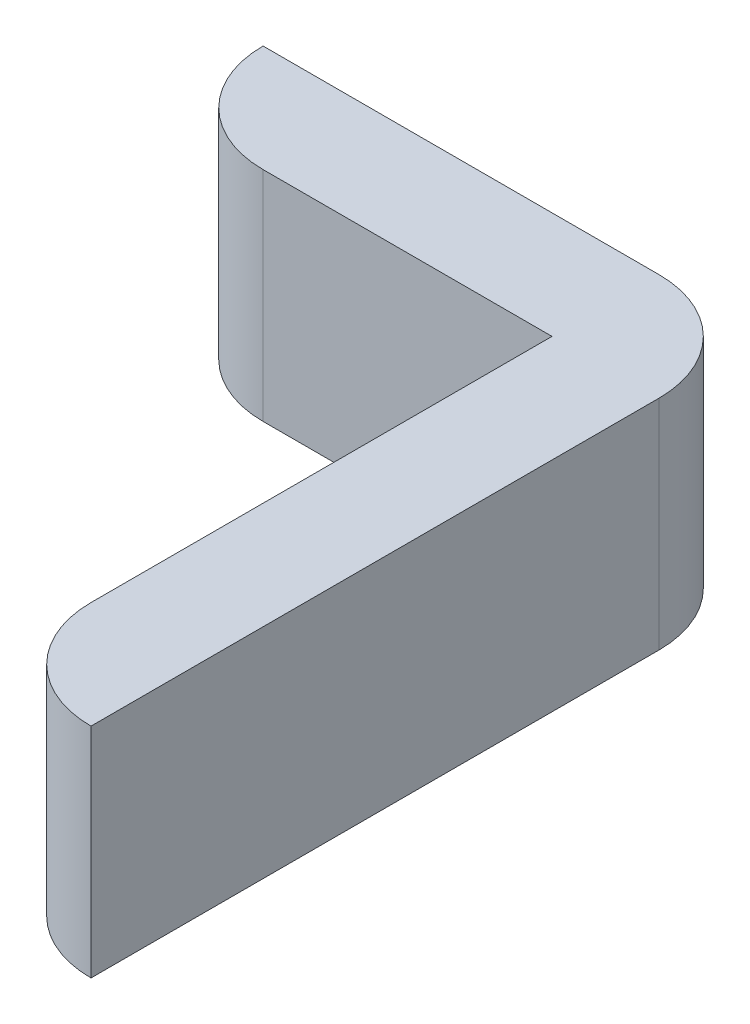
ISO-10303-21;
HEADER;
FILE_DESCRIPTION(('STEP AP214'),'2;1');
FILE_NAME('part.step','',(''),(''),'','','');
FILE_SCHEMA(('AUTOMOTIVE_DESIGN { 1 0 10303 214 1 1 1 1 }'));
ENDSEC;
DATA;
#1=APPLICATION_CONTEXT('core data for automotive mechanical design processes');
#2=APPLICATION_PROTOCOL_DEFINITION('international standard','automotive_design',2000,#1);
#3=PRODUCT_CONTEXT('',#1,'mechanical');
#4=PRODUCT('Part','Part','',(#3));
#5=PRODUCT_RELATED_PRODUCT_CATEGORY('part','',(#4));
#6=PRODUCT_DEFINITION_FORMATION('','',#4);
#7=PRODUCT_DEFINITION_CONTEXT('part definition',#1,'design');
#8=PRODUCT_DEFINITION('design','',#6,#7);
#9=PRODUCT_DEFINITION_SHAPE('','',#8);
#10=(LENGTH_UNIT() NAMED_UNIT(*) SI_UNIT(.MILLI.,.METRE.));
#11=(NAMED_UNIT(*) PLANE_ANGLE_UNIT() SI_UNIT($,.RADIAN.));
#12=(NAMED_UNIT(*) SI_UNIT($,.STERADIAN.) SOLID_ANGLE_UNIT());
#13=UNCERTAINTY_MEASURE_WITH_UNIT(LENGTH_MEASURE(1.E-05),#10,'distance_accuracy_value','');
#14=(GEOMETRIC_REPRESENTATION_CONTEXT(3) GLOBAL_UNCERTAINTY_ASSIGNED_CONTEXT((#13)) GLOBAL_UNIT_ASSIGNED_CONTEXT((#10,
#11,#12)) REPRESENTATION_CONTEXT('',''));
#15=CARTESIAN_POINT('',(0.,0.,0.));
#16=DIRECTION('',(0.,0.,1.));
#17=DIRECTION('',(1.,0.,0.));
#18=AXIS2_PLACEMENT_3D('',#15,#16,#17);
#19=CARTESIAN_POINT('',(-0.125,-6.0952,0.));
#20=DIRECTION('',(0.,-1.,0.));
#21=DIRECTION('',(0.,0.,-1.));
#22=AXIS2_PLACEMENT_3D('',#19,#20,#21);
#23=PLANE('',#22);
#24=DIRECTION('',(-1.,0.,0.));
#25=VECTOR('',#24,1.);
#26=CARTESIAN_POINT('',(0.125,-6.0952,0.25));
#27=LINE('',#26,#25);
#28=CARTESIAN_POINT('',(0.125,-6.0952,0.25));
#29=VERTEX_POINT('',#28);
#30=CARTESIAN_POINT('',(0.8,-6.0952,0.25));
#31=VERTEX_POINT('',#30);
#32=EDGE_CURVE('E102',#29,#31,#27,.F.);
#33=ORIENTED_EDGE('',*,*,#32,.T.);
#34=DIRECTION('',(0.,0.,-1.));
#35=VECTOR('',#34,1.);
#36=CARTESIAN_POINT('',(0.8,-6.0952,0.25));
#37=LINE('',#36,#35);
#38=CARTESIAN_POINT('',(0.8,-6.0952,1.327));
#39=VERTEX_POINT('',#38);
#40=EDGE_CURVE('E108',#31,#39,#37,.F.);
#41=ORIENTED_EDGE('',*,*,#40,.T.);
#42=CARTESIAN_POINT('',(1.05,-6.0952,1.327));
#43=DIRECTION('',(0.,-1.,0.));
#44=DIRECTION('',(0.,0.,-1.));
#45=AXIS2_PLACEMENT_3D('',#42,#43,#44);
#46=CIRCLE('',#45,0.25);
#47=CARTESIAN_POINT('',(1.05,-6.0952,1.577));
#48=VERTEX_POINT('',#47);
#49=EDGE_CURVE('E80',#48,#39,#46,.T.);
#50=ORIENTED_EDGE('',*,*,#49,.F.);
#51=DIRECTION('',(0.,0.,1.));
#52=VECTOR('',#51,1.);
#53=CARTESIAN_POINT('',(1.05,-6.0952,1.577));
#54=LINE('',#53,#52);
#55=CARTESIAN_POINT('',(1.05,-6.0952,0.25));
#56=VERTEX_POINT('',#55);
#57=EDGE_CURVE('E75',#48,#56,#54,.F.);
#58=ORIENTED_EDGE('',*,*,#57,.T.);
#59=CARTESIAN_POINT('',(0.8,-6.0952,0.25));
#60=DIRECTION('',(0.,-1.,0.));
#61=DIRECTION('',(0.,0.,-1.));
#62=AXIS2_PLACEMENT_3D('',#59,#60,#61);
#63=CIRCLE('',#62,0.25);
#64=CARTESIAN_POINT('',(0.8,-6.0952,0.));
#65=VERTEX_POINT('',#64);
#66=EDGE_CURVE('E19',#65,#56,#63,.T.);
#67=ORIENTED_EDGE('',*,*,#66,.F.);
#68=DIRECTION('',(1.,0.,0.));
#69=VECTOR('',#68,1.);
#70=CARTESIAN_POINT('',(0.8,-6.0952,0.));
#71=LINE('',#70,#69);
#72=CARTESIAN_POINT('',(-0.125,-6.0952,0.));
#73=VERTEX_POINT('',#72);
#74=EDGE_CURVE('E70',#65,#73,#71,.F.);
#75=ORIENTED_EDGE('',*,*,#74,.T.);
#76=CARTESIAN_POINT('',(0.125,-6.0952,0.));
#77=DIRECTION('',(0.,-1.,0.));
#78=DIRECTION('',(0.,0.,-1.));
#79=AXIS2_PLACEMENT_3D('',#76,#77,#78);
#80=CIRCLE('',#79,0.25);
#81=EDGE_CURVE('E121',#29,#73,#80,.T.);
#82=ORIENTED_EDGE('',*,*,#81,.F.);
#83=EDGE_LOOP('',(#33,#41,#50,#58,#67,#75,#82));
#84=FACE_BOUND('',#83,.T.);
#85=ADVANCED_FACE('F16',(#84),#23,.F.);
#86=CARTESIAN_POINT('',(0.8,-6.6048,0.));
#87=DIRECTION('',(0.,0.,1.));
#88=DIRECTION('',(1.,0.,0.));
#89=AXIS2_PLACEMENT_3D('',#86,#87,#88);
#90=PLANE('',#89);
#91=DIRECTION('',(0.,-1.,0.));
#92=VECTOR('',#91,1.);
#93=CARTESIAN_POINT('',(-0.125,-6.6048,0.));
#94=LINE('',#93,#92);
#95=CARTESIAN_POINT('',(-0.125,-6.6048,0.));
#96=VERTEX_POINT('',#95);
#97=EDGE_CURVE('E123',#73,#96,#94,.T.);
#98=ORIENTED_EDGE('',*,*,#97,.F.);
#99=ORIENTED_EDGE('',*,*,#74,.F.);
#100=DIRECTION('',(0.,-1.,0.));
#101=VECTOR('',#100,1.);
#102=CARTESIAN_POINT('',(0.8,-6.6048,0.));
#103=LINE('',#102,#101);
#104=CARTESIAN_POINT('',(0.8,-6.6048,0.));
#105=VERTEX_POINT('',#104);
#106=EDGE_CURVE('E92',#105,#65,#103,.F.);
#107=ORIENTED_EDGE('',*,*,#106,.F.);
#108=DIRECTION('',(1.,0.,0.));
#109=VECTOR('',#108,1.);
#110=CARTESIAN_POINT('',(-0.125,-6.6048,0.));
#111=LINE('',#110,#109);
#112=EDGE_CURVE('E120',#96,#105,#111,.T.);
#113=ORIENTED_EDGE('',*,*,#112,.F.);
#114=EDGE_LOOP('',(#98,#99,#107,#113));
#115=FACE_BOUND('',#114,.T.);
#116=ADVANCED_FACE('F158',(#115),#90,.F.);
#117=CARTESIAN_POINT('',(0.8,-6.6048,0.25));
#118=DIRECTION('',(0.,-1.,0.));
#119=DIRECTION('',(0.,0.,-1.));
#120=AXIS2_PLACEMENT_3D('',#117,#118,#119);
#121=CYLINDRICAL_SURFACE('',#120,0.25);
#122=ORIENTED_EDGE('',*,*,#66,.T.);
#123=DIRECTION('',(0.,1.,0.));
#124=VECTOR('',#123,1.);
#125=CARTESIAN_POINT('',(1.05,-6.6048,0.25));
#126=LINE('',#125,#124);
#127=CARTESIAN_POINT('',(1.05,-6.6048,0.25));
#128=VERTEX_POINT('',#127);
#129=EDGE_CURVE('E86',#56,#128,#126,.F.);
#130=ORIENTED_EDGE('',*,*,#129,.T.);
#131=CARTESIAN_POINT('',(0.8,-6.6048,0.25));
#132=DIRECTION('',(0.,-1.,0.));
#133=DIRECTION('',(0.,0.,-1.));
#134=AXIS2_PLACEMENT_3D('',#131,#132,#133);
#135=CIRCLE('',#134,0.25);
#136=EDGE_CURVE('E118',#105,#128,#135,.T.);
#137=ORIENTED_EDGE('',*,*,#136,.F.);
#138=ORIENTED_EDGE('',*,*,#106,.T.);
#139=EDGE_LOOP('',(#122,#130,#137,#138));
#140=FACE_BOUND('',#139,.T.);
#141=ADVANCED_FACE('F89',(#140),#121,.T.);
#142=CARTESIAN_POINT('',(1.05,-6.6048,1.577));
#143=DIRECTION('',(-1.,0.,0.));
#144=DIRECTION('',(0.,0.,1.));
#145=AXIS2_PLACEMENT_3D('',#142,#143,#144);
#146=PLANE('',#145);
#147=DIRECTION('',(0.,-1.,0.));
#148=VECTOR('',#147,1.);
#149=CARTESIAN_POINT('',(1.05,-6.6048,1.577));
#150=LINE('',#149,#148);
#151=CARTESIAN_POINT('',(1.05,-6.6048,1.577));
#152=VERTEX_POINT('',#151);
#153=EDGE_CURVE('E85',#152,#48,#150,.F.);
#154=ORIENTED_EDGE('',*,*,#153,.F.);
#155=DIRECTION('',(0.,0.,-1.));
#156=VECTOR('',#155,1.);
#157=CARTESIAN_POINT('',(1.05,-6.6048,0.));
#158=LINE('',#157,#156);
#159=EDGE_CURVE('E94',#128,#152,#158,.F.);
#160=ORIENTED_EDGE('',*,*,#159,.F.);
#161=ORIENTED_EDGE('',*,*,#129,.F.);
#162=ORIENTED_EDGE('',*,*,#57,.F.);
#163=EDGE_LOOP('',(#154,#160,#161,#162));
#164=FACE_BOUND('',#163,.T.);
#165=ADVANCED_FACE('F93',(#164),#146,.F.);
#166=CARTESIAN_POINT('',(1.05,-6.6048,1.327));
#167=DIRECTION('',(0.,-1.,0.));
#168=DIRECTION('',(0.,0.,-1.));
#169=AXIS2_PLACEMENT_3D('',#166,#167,#168);
#170=CYLINDRICAL_SURFACE('',#169,0.25);
#171=ORIENTED_EDGE('',*,*,#49,.T.);
#172=DIRECTION('',(0.,1.,0.));
#173=VECTOR('',#172,1.);
#174=CARTESIAN_POINT('',(0.8,-6.6048,1.327));
#175=LINE('',#174,#173);
#176=CARTESIAN_POINT('',(0.8,-6.6048,1.327));
#177=VERTEX_POINT('',#176);
#178=EDGE_CURVE('E105',#39,#177,#175,.F.);
#179=ORIENTED_EDGE('',*,*,#178,.T.);
#180=CARTESIAN_POINT('',(1.05,-6.6048,1.327));
#181=DIRECTION('',(0.,-1.,0.));
#182=DIRECTION('',(0.,0.,-1.));
#183=AXIS2_PLACEMENT_3D('',#180,#181,#182);
#184=CIRCLE('',#183,0.25);
#185=EDGE_CURVE('E114',#152,#177,#184,.T.);
#186=ORIENTED_EDGE('',*,*,#185,.F.);
#187=ORIENTED_EDGE('',*,*,#153,.T.);
#188=EDGE_LOOP('',(#171,#179,#186,#187));
#189=FACE_BOUND('',#188,.T.);
#190=ADVANCED_FACE('F127',(#189),#170,.T.);
#191=CARTESIAN_POINT('',(0.8,-6.6048,0.25));
#192=DIRECTION('',(1.,0.,0.));
#193=DIRECTION('',(0.,0.,-1.));
#194=AXIS2_PLACEMENT_3D('',#191,#192,#193);
#195=PLANE('',#194);
#196=ORIENTED_EDGE('',*,*,#178,.F.);
#197=ORIENTED_EDGE('',*,*,#40,.F.);
#198=DIRECTION('',(0.,1.,0.));
#199=VECTOR('',#198,1.);
#200=CARTESIAN_POINT('',(0.8,-6.6048,0.25));
#201=LINE('',#200,#199);
#202=CARTESIAN_POINT('',(0.8,-6.6048,0.25));
#203=VERTEX_POINT('',#202);
#204=EDGE_CURVE('E104',#31,#203,#201,.F.);
#205=ORIENTED_EDGE('',*,*,#204,.T.);
#206=DIRECTION('',(0.,0.,-1.));
#207=VECTOR('',#206,1.);
#208=CARTESIAN_POINT('',(0.8,-6.6048,0.));
#209=LINE('',#208,#207);
#210=EDGE_CURVE('E117',#177,#203,#209,.T.);
#211=ORIENTED_EDGE('',*,*,#210,.F.);
#212=EDGE_LOOP('',(#196,#197,#205,#211));
#213=FACE_BOUND('',#212,.T.);
#214=ADVANCED_FACE('F150',(#213),#195,.F.);
#215=CARTESIAN_POINT('',(0.125,-6.6048,0.25));
#216=DIRECTION('',(0.,0.,-1.));
#217=DIRECTION('',(-1.,0.,0.));
#218=AXIS2_PLACEMENT_3D('',#215,#216,#217);
#219=PLANE('',#218);
#220=ORIENTED_EDGE('',*,*,#204,.F.);
#221=ORIENTED_EDGE('',*,*,#32,.F.);
#222=DIRECTION('',(0.,-1.,0.));
#223=VECTOR('',#222,1.);
#224=CARTESIAN_POINT('',(0.125,-6.6048,0.25));
#225=LINE('',#224,#223);
#226=CARTESIAN_POINT('',(0.125,-6.6048,0.25));
#227=VERTEX_POINT('',#226);
#228=EDGE_CURVE('E34',#227,#29,#225,.F.);
#229=ORIENTED_EDGE('',*,*,#228,.F.);
#230=DIRECTION('',(1.,0.,0.));
#231=VECTOR('',#230,1.);
#232=CARTESIAN_POINT('',(-0.125,-6.6048,0.25));
#233=LINE('',#232,#231);
#234=EDGE_CURVE('E25',#203,#227,#233,.F.);
#235=ORIENTED_EDGE('',*,*,#234,.F.);
#236=EDGE_LOOP('',(#220,#221,#229,#235));
#237=FACE_BOUND('',#236,.T.);
#238=ADVANCED_FACE('F151',(#237),#219,.F.);
#239=CARTESIAN_POINT('',(0.125,-6.6048,0.));
#240=DIRECTION('',(0.,-1.,0.));
#241=DIRECTION('',(0.,0.,-1.));
#242=AXIS2_PLACEMENT_3D('',#239,#240,#241);
#243=CYLINDRICAL_SURFACE('',#242,0.25);
#244=ORIENTED_EDGE('',*,*,#81,.T.);
#245=ORIENTED_EDGE('',*,*,#97,.T.);
#246=CARTESIAN_POINT('',(0.125,-6.6048,0.));
#247=DIRECTION('',(0.,-1.,0.));
#248=DIRECTION('',(0.,0.,-1.));
#249=AXIS2_PLACEMENT_3D('',#246,#247,#248);
#250=CIRCLE('',#249,0.25);
#251=EDGE_CURVE('E11',#227,#96,#250,.T.);
#252=ORIENTED_EDGE('',*,*,#251,.F.);
#253=ORIENTED_EDGE('',*,*,#228,.T.);
#254=EDGE_LOOP('',(#244,#245,#252,#253));
#255=FACE_BOUND('',#254,.T.);
#256=ADVANCED_FACE('F156',(#255),#243,.T.);
#257=CARTESIAN_POINT('',(-0.125,-6.6048,0.));
#258=DIRECTION('',(0.,-1.,0.));
#259=DIRECTION('',(0.,0.,-1.));
#260=AXIS2_PLACEMENT_3D('',#257,#258,#259);
#261=PLANE('',#260);
#262=ORIENTED_EDGE('',*,*,#234,.T.);
#263=ORIENTED_EDGE('',*,*,#251,.T.);
#264=ORIENTED_EDGE('',*,*,#112,.T.);
#265=ORIENTED_EDGE('',*,*,#136,.T.);
#266=ORIENTED_EDGE('',*,*,#159,.T.);
#267=ORIENTED_EDGE('',*,*,#185,.T.);
#268=ORIENTED_EDGE('',*,*,#210,.T.);
#269=EDGE_LOOP('',(#262,#263,#264,#265,#266,#267,#268));
#270=FACE_BOUND('',#269,.T.);
#271=ADVANCED_FACE('F132',(#270),#261,.T.);
#272=CLOSED_SHELL('',(#85,#116,#141,#165,#190,#214,#238,#256,#271));
#273=MANIFOLD_SOLID_BREP('B1',#272);
#274=ADVANCED_BREP_SHAPE_REPRESENTATION('',(#18,#273),#14);
#275=SHAPE_DEFINITION_REPRESENTATION(#9,#274);
ENDSEC;
END-ISO-10303-21;
